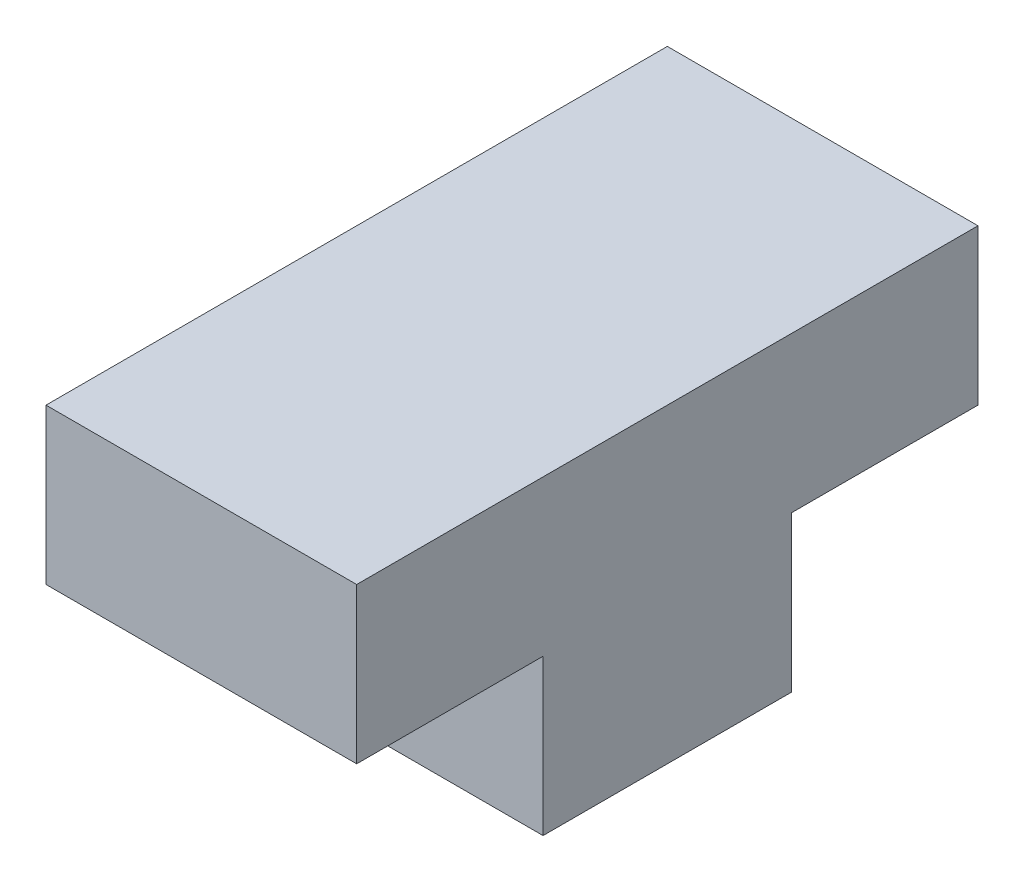
ISO-10303-21;
HEADER;
FILE_DESCRIPTION(('STEP AP214'),'2;1');
FILE_NAME('part.step','',(''),(''),'','','');
FILE_SCHEMA(('AUTOMOTIVE_DESIGN { 1 0 10303 214 1 1 1 1 }'));
ENDSEC;
DATA;
#1=APPLICATION_CONTEXT('core data for automotive mechanical design processes');
#2=APPLICATION_PROTOCOL_DEFINITION('international standard','automotive_design',2000,#1);
#3=PRODUCT_CONTEXT('',#1,'mechanical');
#4=PRODUCT('Part','Part','',(#3));
#5=PRODUCT_RELATED_PRODUCT_CATEGORY('part','',(#4));
#6=PRODUCT_DEFINITION_FORMATION('','',#4);
#7=PRODUCT_DEFINITION_CONTEXT('part definition',#1,'design');
#8=PRODUCT_DEFINITION('design','',#6,#7);
#9=PRODUCT_DEFINITION_SHAPE('','',#8);
#10=(LENGTH_UNIT() NAMED_UNIT(*) SI_UNIT(.MILLI.,.METRE.));
#11=(NAMED_UNIT(*) PLANE_ANGLE_UNIT() SI_UNIT($,.RADIAN.));
#12=(NAMED_UNIT(*) SI_UNIT($,.STERADIAN.) SOLID_ANGLE_UNIT());
#13=UNCERTAINTY_MEASURE_WITH_UNIT(LENGTH_MEASURE(1.E-05),#10,'distance_accuracy_value','');
#14=(GEOMETRIC_REPRESENTATION_CONTEXT(3) GLOBAL_UNCERTAINTY_ASSIGNED_CONTEXT((#13)) GLOBAL_UNIT_ASSIGNED_CONTEXT((#10,
#11,#12)) REPRESENTATION_CONTEXT('',''));
#15=CARTESIAN_POINT('',(0.,0.,0.));
#16=DIRECTION('',(0.,0.,1.));
#17=DIRECTION('',(1.,0.,0.));
#18=AXIS2_PLACEMENT_3D('',#15,#16,#17);
#19=CARTESIAN_POINT('',(10.,0.,-4.));
#20=DIRECTION('',(0.,0.,1.));
#21=DIRECTION('',(1.,0.,0.));
#22=AXIS2_PLACEMENT_3D('',#19,#20,#21);
#23=PLANE('',#22);
#24=DIRECTION('',(0.,1.,0.));
#25=VECTOR('',#24,1.);
#26=CARTESIAN_POINT('',(0.,0.,-4.));
#27=LINE('',#26,#25);
#28=CARTESIAN_POINT('',(0.,0.,-4.));
#29=VERTEX_POINT('',#28);
#30=CARTESIAN_POINT('',(0.,5.,-4.));
#31=VERTEX_POINT('',#30);
#32=EDGE_CURVE('E144',#29,#31,#27,.T.);
#33=ORIENTED_EDGE('',*,*,#32,.T.);
#34=DIRECTION('',(-1.,0.,0.));
#35=VECTOR('',#34,1.);
#36=CARTESIAN_POINT('',(10.,5.,-4.));
#37=LINE('',#36,#35);
#38=CARTESIAN_POINT('',(10.,5.,-4.));
#39=VERTEX_POINT('',#38);
#40=EDGE_CURVE('E11',#39,#31,#37,.T.);
#41=ORIENTED_EDGE('',*,*,#40,.F.);
#42=DIRECTION('',(0.,1.,0.));
#43=VECTOR('',#42,1.);
#44=CARTESIAN_POINT('',(10.,0.,-4.));
#45=LINE('',#44,#43);
#46=CARTESIAN_POINT('',(10.,0.,-4.));
#47=VERTEX_POINT('',#46);
#48=EDGE_CURVE('E166',#47,#39,#45,.T.);
#49=ORIENTED_EDGE('',*,*,#48,.F.);
#50=DIRECTION('',(-1.,0.,0.));
#51=VECTOR('',#50,1.);
#52=CARTESIAN_POINT('',(10.,0.,-4.));
#53=LINE('',#52,#51);
#54=EDGE_CURVE('E140',#47,#29,#53,.T.);
#55=ORIENTED_EDGE('',*,*,#54,.T.);
#56=EDGE_LOOP('',(#33,#41,#49,#55));
#57=FACE_BOUND('',#56,.T.);
#58=ADVANCED_FACE('F43',(#57),#23,.F.);
#59=CARTESIAN_POINT('',(10.,5.,-4.));
#60=DIRECTION('',(0.,1.,0.));
#61=DIRECTION('',(0.,0.,1.));
#62=AXIS2_PLACEMENT_3D('',#59,#60,#61);
#63=PLANE('',#62);
#64=DIRECTION('',(0.,0.,-1.));
#65=VECTOR('',#64,1.);
#66=CARTESIAN_POINT('',(0.,5.,-4.));
#67=LINE('',#66,#65);
#68=CARTESIAN_POINT('',(0.,5.,-10.));
#69=VERTEX_POINT('',#68);
#70=EDGE_CURVE('E148',#31,#69,#67,.T.);
#71=ORIENTED_EDGE('',*,*,#70,.T.);
#72=DIRECTION('',(-1.,0.,0.));
#73=VECTOR('',#72,1.);
#74=CARTESIAN_POINT('',(10.,5.,-10.));
#75=LINE('',#74,#73);
#76=CARTESIAN_POINT('',(10.,5.,-10.));
#77=VERTEX_POINT('',#76);
#78=EDGE_CURVE('E52',#77,#69,#75,.T.);
#79=ORIENTED_EDGE('',*,*,#78,.F.);
#80=DIRECTION('',(0.,0.,-1.));
#81=VECTOR('',#80,1.);
#82=CARTESIAN_POINT('',(10.,5.,-4.));
#83=LINE('',#82,#81);
#84=EDGE_CURVE('E103',#39,#77,#83,.T.);
#85=ORIENTED_EDGE('',*,*,#84,.F.);
#86=ORIENTED_EDGE('',*,*,#40,.T.);
#87=EDGE_LOOP('',(#71,#79,#85,#86));
#88=FACE_BOUND('',#87,.T.);
#89=ADVANCED_FACE('F212',(#88),#63,.F.);
#90=CARTESIAN_POINT('',(10.,5.,-10.));
#91=DIRECTION('',(0.,0.,1.));
#92=DIRECTION('',(1.,0.,0.));
#93=AXIS2_PLACEMENT_3D('',#90,#91,#92);
#94=PLANE('',#93);
#95=DIRECTION('',(0.,1.,0.));
#96=VECTOR('',#95,1.);
#97=CARTESIAN_POINT('',(0.,5.,-10.));
#98=LINE('',#97,#96);
#99=CARTESIAN_POINT('',(0.,10.,-10.));
#100=VERTEX_POINT('',#99);
#101=EDGE_CURVE('E151',#69,#100,#98,.T.);
#102=ORIENTED_EDGE('',*,*,#101,.T.);
#103=DIRECTION('',(-1.,0.,0.));
#104=VECTOR('',#103,1.);
#105=CARTESIAN_POINT('',(10.,10.,-10.));
#106=LINE('',#105,#104);
#107=CARTESIAN_POINT('',(10.,10.,-10.));
#108=VERTEX_POINT('',#107);
#109=EDGE_CURVE('E177',#108,#100,#106,.T.);
#110=ORIENTED_EDGE('',*,*,#109,.F.);
#111=DIRECTION('',(0.,1.,0.));
#112=VECTOR('',#111,1.);
#113=CARTESIAN_POINT('',(10.,5.,-10.));
#114=LINE('',#113,#112);
#115=EDGE_CURVE('E187',#77,#108,#114,.T.);
#116=ORIENTED_EDGE('',*,*,#115,.F.);
#117=ORIENTED_EDGE('',*,*,#78,.T.);
#118=EDGE_LOOP('',(#102,#110,#116,#117));
#119=FACE_BOUND('',#118,.T.);
#120=ADVANCED_FACE('F185',(#119),#94,.F.);
#121=CARTESIAN_POINT('',(10.,10.,-10.));
#122=DIRECTION('',(0.,-1.,0.));
#123=DIRECTION('',(0.,0.,-1.));
#124=AXIS2_PLACEMENT_3D('',#121,#122,#123);
#125=PLANE('',#124);
#126=DIRECTION('',(0.,0.,1.));
#127=VECTOR('',#126,1.);
#128=CARTESIAN_POINT('',(0.,10.,-10.));
#129=LINE('',#128,#127);
#130=CARTESIAN_POINT('',(0.,10.,10.));
#131=VERTEX_POINT('',#130);
#132=EDGE_CURVE('E154',#100,#131,#129,.T.);
#133=ORIENTED_EDGE('',*,*,#132,.T.);
#134=DIRECTION('',(-1.,0.,0.));
#135=VECTOR('',#134,1.);
#136=CARTESIAN_POINT('',(10.,10.,10.));
#137=LINE('',#136,#135);
#138=CARTESIAN_POINT('',(10.,10.,10.));
#139=VERTEX_POINT('',#138);
#140=EDGE_CURVE('E173',#139,#131,#137,.T.);
#141=ORIENTED_EDGE('',*,*,#140,.F.);
#142=DIRECTION('',(0.,0.,1.));
#143=VECTOR('',#142,1.);
#144=CARTESIAN_POINT('',(10.,10.,-10.));
#145=LINE('',#144,#143);
#146=EDGE_CURVE('E200',#108,#139,#145,.T.);
#147=ORIENTED_EDGE('',*,*,#146,.F.);
#148=ORIENTED_EDGE('',*,*,#109,.T.);
#149=EDGE_LOOP('',(#133,#141,#147,#148));
#150=FACE_BOUND('',#149,.T.);
#151=ADVANCED_FACE('F195',(#150),#125,.F.);
#152=CARTESIAN_POINT('',(10.,5.,10.));
#153=DIRECTION('',(0.,0.,-1.));
#154=DIRECTION('',(-1.,0.,0.));
#155=AXIS2_PLACEMENT_3D('',#152,#153,#154);
#156=PLANE('',#155);
#157=DIRECTION('',(0.,-1.,0.));
#158=VECTOR('',#157,1.);
#159=CARTESIAN_POINT('',(0.,5.,10.));
#160=LINE('',#159,#158);
#161=CARTESIAN_POINT('',(0.,5.,10.));
#162=VERTEX_POINT('',#161);
#163=EDGE_CURVE('E157',#131,#162,#160,.T.);
#164=ORIENTED_EDGE('',*,*,#163,.T.);
#165=DIRECTION('',(-1.,0.,0.));
#166=VECTOR('',#165,1.);
#167=CARTESIAN_POINT('',(10.,5.,10.));
#168=LINE('',#167,#166);
#169=CARTESIAN_POINT('',(10.,5.,10.));
#170=VERTEX_POINT('',#169);
#171=EDGE_CURVE('E133',#170,#162,#168,.T.);
#172=ORIENTED_EDGE('',*,*,#171,.F.);
#173=DIRECTION('',(0.,-1.,0.));
#174=VECTOR('',#173,1.);
#175=CARTESIAN_POINT('',(10.,5.,10.));
#176=LINE('',#175,#174);
#177=EDGE_CURVE('E122',#139,#170,#176,.T.);
#178=ORIENTED_EDGE('',*,*,#177,.F.);
#179=ORIENTED_EDGE('',*,*,#140,.T.);
#180=EDGE_LOOP('',(#164,#172,#178,#179));
#181=FACE_BOUND('',#180,.T.);
#182=ADVANCED_FACE('F198',(#181),#156,.F.);
#183=CARTESIAN_POINT('',(10.,5.,4.));
#184=DIRECTION('',(0.,1.,0.));
#185=DIRECTION('',(0.,0.,1.));
#186=AXIS2_PLACEMENT_3D('',#183,#184,#185);
#187=PLANE('',#186);
#188=DIRECTION('',(0.,0.,-1.));
#189=VECTOR('',#188,1.);
#190=CARTESIAN_POINT('',(0.,5.,4.));
#191=LINE('',#190,#189);
#192=CARTESIAN_POINT('',(0.,5.,4.));
#193=VERTEX_POINT('',#192);
#194=EDGE_CURVE('E131',#162,#193,#191,.T.);
#195=ORIENTED_EDGE('',*,*,#194,.T.);
#196=DIRECTION('',(-1.,0.,0.));
#197=VECTOR('',#196,1.);
#198=CARTESIAN_POINT('',(10.,5.,4.));
#199=LINE('',#198,#197);
#200=CARTESIAN_POINT('',(10.,5.,4.));
#201=VERTEX_POINT('',#200);
#202=EDGE_CURVE('E128',#201,#193,#199,.T.);
#203=ORIENTED_EDGE('',*,*,#202,.F.);
#204=DIRECTION('',(0.,0.,-1.));
#205=VECTOR('',#204,1.);
#206=CARTESIAN_POINT('',(10.,5.,4.));
#207=LINE('',#206,#205);
#208=EDGE_CURVE('E116',#170,#201,#207,.T.);
#209=ORIENTED_EDGE('',*,*,#208,.F.);
#210=ORIENTED_EDGE('',*,*,#171,.T.);
#211=EDGE_LOOP('',(#195,#203,#209,#210));
#212=FACE_BOUND('',#211,.T.);
#213=ADVANCED_FACE('F129',(#212),#187,.F.);
#214=CARTESIAN_POINT('',(10.,0.,4.));
#215=DIRECTION('',(0.,0.,-1.));
#216=DIRECTION('',(-1.,0.,0.));
#217=AXIS2_PLACEMENT_3D('',#214,#215,#216);
#218=PLANE('',#217);
#219=DIRECTION('',(0.,-1.,0.));
#220=VECTOR('',#219,1.);
#221=CARTESIAN_POINT('',(0.,0.,4.));
#222=LINE('',#221,#220);
#223=CARTESIAN_POINT('',(0.,0.,4.));
#224=VERTEX_POINT('',#223);
#225=EDGE_CURVE('E89',#193,#224,#222,.T.);
#226=ORIENTED_EDGE('',*,*,#225,.T.);
#227=DIRECTION('',(-1.,0.,0.));
#228=VECTOR('',#227,1.);
#229=CARTESIAN_POINT('',(10.,0.,4.));
#230=LINE('',#229,#228);
#231=CARTESIAN_POINT('',(10.,0.,4.));
#232=VERTEX_POINT('',#231);
#233=EDGE_CURVE('E134',#232,#224,#230,.T.);
#234=ORIENTED_EDGE('',*,*,#233,.F.);
#235=DIRECTION('',(0.,-1.,0.));
#236=VECTOR('',#235,1.);
#237=CARTESIAN_POINT('',(10.,0.,4.));
#238=LINE('',#237,#236);
#239=EDGE_CURVE('E120',#201,#232,#238,.T.);
#240=ORIENTED_EDGE('',*,*,#239,.F.);
#241=ORIENTED_EDGE('',*,*,#202,.T.);
#242=EDGE_LOOP('',(#226,#234,#240,#241));
#243=FACE_BOUND('',#242,.T.);
#244=ADVANCED_FACE('F136',(#243),#218,.F.);
#245=CARTESIAN_POINT('',(10.,0.,4.));
#246=DIRECTION('',(0.,1.,0.));
#247=DIRECTION('',(0.,0.,1.));
#248=AXIS2_PLACEMENT_3D('',#245,#246,#247);
#249=PLANE('',#248);
#250=DIRECTION('',(0.,0.,-1.));
#251=VECTOR('',#250,1.);
#252=CARTESIAN_POINT('',(0.,0.,4.));
#253=LINE('',#252,#251);
#254=EDGE_CURVE('E95',#224,#29,#253,.T.);
#255=ORIENTED_EDGE('',*,*,#254,.T.);
#256=ORIENTED_EDGE('',*,*,#54,.F.);
#257=DIRECTION('',(0.,0.,-1.));
#258=VECTOR('',#257,1.);
#259=CARTESIAN_POINT('',(10.,0.,4.));
#260=LINE('',#259,#258);
#261=EDGE_CURVE('E60',#232,#47,#260,.T.);
#262=ORIENTED_EDGE('',*,*,#261,.F.);
#263=ORIENTED_EDGE('',*,*,#233,.T.);
#264=EDGE_LOOP('',(#255,#256,#262,#263));
#265=FACE_BOUND('',#264,.T.);
#266=ADVANCED_FACE('F228',(#265),#249,.F.);
#267=CARTESIAN_POINT('',(10.,0.,0.));
#268=DIRECTION('',(-1.,0.,0.));
#269=DIRECTION('',(0.,0.,1.));
#270=AXIS2_PLACEMENT_3D('',#267,#268,#269);
#271=PLANE('',#270);
#272=ORIENTED_EDGE('',*,*,#48,.T.);
#273=ORIENTED_EDGE('',*,*,#84,.T.);
#274=ORIENTED_EDGE('',*,*,#115,.T.);
#275=ORIENTED_EDGE('',*,*,#146,.T.);
#276=ORIENTED_EDGE('',*,*,#177,.T.);
#277=ORIENTED_EDGE('',*,*,#208,.T.);
#278=ORIENTED_EDGE('',*,*,#239,.T.);
#279=ORIENTED_EDGE('',*,*,#261,.T.);
#280=EDGE_LOOP('',(#272,#273,#274,#275,#276,#277,#278,#279));
#281=FACE_BOUND('',#280,.T.);
#282=ADVANCED_FACE('F118',(#281),#271,.F.);
#283=CARTESIAN_POINT('',(0.,0.,0.));
#284=DIRECTION('',(-1.,0.,0.));
#285=DIRECTION('',(0.,0.,1.));
#286=AXIS2_PLACEMENT_3D('',#283,#284,#285);
#287=PLANE('',#286);
#288=ORIENTED_EDGE('',*,*,#32,.F.);
#289=ORIENTED_EDGE('',*,*,#254,.F.);
#290=ORIENTED_EDGE('',*,*,#225,.F.);
#291=ORIENTED_EDGE('',*,*,#194,.F.);
#292=ORIENTED_EDGE('',*,*,#163,.F.);
#293=ORIENTED_EDGE('',*,*,#132,.F.);
#294=ORIENTED_EDGE('',*,*,#101,.F.);
#295=ORIENTED_EDGE('',*,*,#70,.F.);
#296=EDGE_LOOP('',(#288,#289,#290,#291,#292,#293,#294,#295));
#297=FACE_BOUND('',#296,.T.);
#298=ADVANCED_FACE('F191',(#297),#287,.T.);
#299=CLOSED_SHELL('',(#58,#89,#120,#151,#182,#213,#244,#266,#282,#298));
#300=MANIFOLD_SOLID_BREP('B2',#299);
#301=ADVANCED_BREP_SHAPE_REPRESENTATION('',(#18,#300),#14);
#302=SHAPE_DEFINITION_REPRESENTATION(#9,#301);
ENDSEC;
END-ISO-10303-21;
